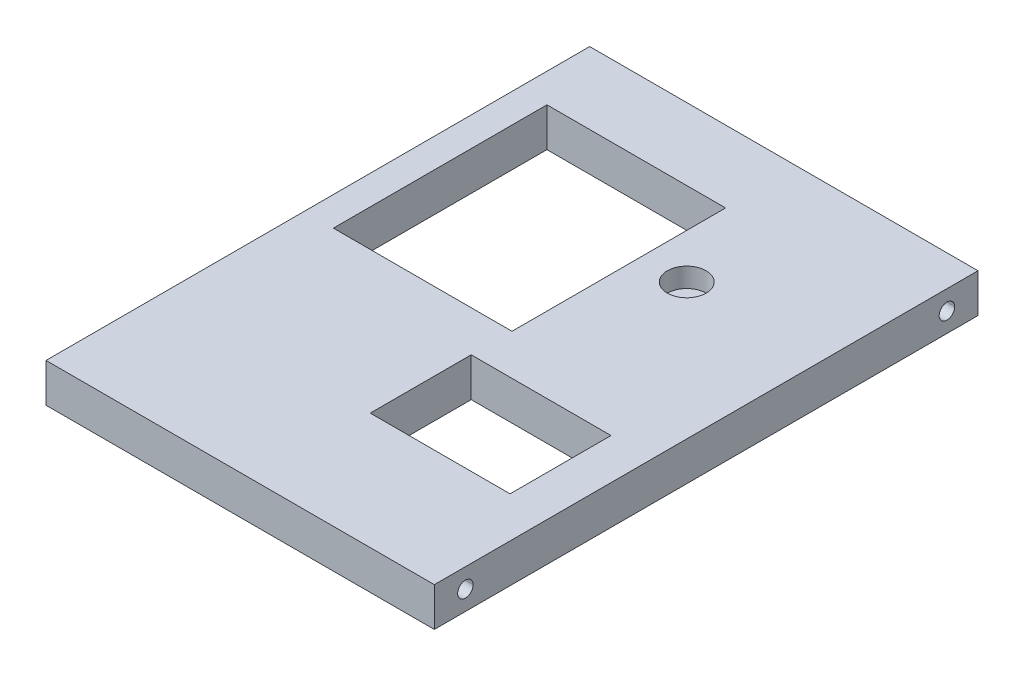
ISO-10303-21;
HEADER;
FILE_DESCRIPTION(('STEP AP214'),'2;1');
FILE_NAME('part.step','',(''),(''),'','','');
FILE_SCHEMA(('AUTOMOTIVE_DESIGN { 1 0 10303 214 1 1 1 1 }'));
ENDSEC;
DATA;
#1=APPLICATION_CONTEXT('core data for automotive mechanical design processes');
#2=APPLICATION_PROTOCOL_DEFINITION('international standard','automotive_design',2000,#1);
#3=PRODUCT_CONTEXT('',#1,'mechanical');
#4=PRODUCT('Part','Part','',(#3));
#5=PRODUCT_RELATED_PRODUCT_CATEGORY('part','',(#4));
#6=PRODUCT_DEFINITION_FORMATION('','',#4);
#7=PRODUCT_DEFINITION_CONTEXT('part definition',#1,'design');
#8=PRODUCT_DEFINITION('design','',#6,#7);
#9=PRODUCT_DEFINITION_SHAPE('','',#8);
#10=(LENGTH_UNIT() NAMED_UNIT(*) SI_UNIT(.MILLI.,.METRE.));
#11=(NAMED_UNIT(*) PLANE_ANGLE_UNIT() SI_UNIT($,.RADIAN.));
#12=(NAMED_UNIT(*) SI_UNIT($,.STERADIAN.) SOLID_ANGLE_UNIT());
#13=UNCERTAINTY_MEASURE_WITH_UNIT(LENGTH_MEASURE(1.E-05),#10,'distance_accuracy_value','');
#14=(GEOMETRIC_REPRESENTATION_CONTEXT(3) GLOBAL_UNCERTAINTY_ASSIGNED_CONTEXT((#13)) GLOBAL_UNIT_ASSIGNED_CONTEXT((#10,
#11,#12)) REPRESENTATION_CONTEXT('',''));
#15=CARTESIAN_POINT('',(0.,0.,0.));
#16=DIRECTION('',(0.,0.,1.));
#17=DIRECTION('',(1.,0.,0.));
#18=AXIS2_PLACEMENT_3D('',#15,#16,#17);
#19=CARTESIAN_POINT('',(100.,5.,-132.));
#20=DIRECTION('',(-1.,0.,0.));
#21=DIRECTION('',(0.,0.,1.));
#22=AXIS2_PLACEMENT_3D('',#19,#20,#21);
#23=CYLINDRICAL_SURFACE('',#22,2.);
#24=DIRECTION('',(-1.,0.,0.));
#25=VECTOR('',#24,1.);
#26=CARTESIAN_POINT('',(100.,5.,-134.));
#27=LINE('',#26,#25);
#28=CARTESIAN_POINT('',(0.,5.,-134.));
#29=VERTEX_POINT('',#28);
#30=CARTESIAN_POINT('',(100.,5.,-134.));
#31=VERTEX_POINT('',#30);
#32=EDGE_CURVE('E12',#29,#31,#27,.F.);
#33=ORIENTED_EDGE('',*,*,#32,.F.);
#34=CARTESIAN_POINT('',(0.,5.,-132.));
#35=DIRECTION('',(-1.,0.,0.));
#36=DIRECTION('',(0.,0.,1.));
#37=AXIS2_PLACEMENT_3D('',#34,#35,#36);
#38=CIRCLE('',#37,2.);
#39=CARTESIAN_POINT('',(0.,5.,-130.));
#40=VERTEX_POINT('',#39);
#41=EDGE_CURVE('E210',#29,#40,#38,.T.);
#42=ORIENTED_EDGE('',*,*,#41,.T.);
#43=DIRECTION('',(-1.,0.,0.));
#44=VECTOR('',#43,1.);
#45=CARTESIAN_POINT('',(100.,5.,-130.));
#46=LINE('',#45,#44);
#47=CARTESIAN_POINT('',(100.,5.,-130.));
#48=VERTEX_POINT('',#47);
#49=EDGE_CURVE('E56',#48,#40,#46,.T.);
#50=ORIENTED_EDGE('',*,*,#49,.F.);
#51=CARTESIAN_POINT('',(100.,5.,-132.));
#52=DIRECTION('',(-1.,0.,0.));
#53=DIRECTION('',(0.,0.,1.));
#54=AXIS2_PLACEMENT_3D('',#51,#52,#53);
#55=CIRCLE('',#54,2.);
#56=EDGE_CURVE('E264',#31,#48,#55,.T.);
#57=ORIENTED_EDGE('',*,*,#56,.F.);
#58=EDGE_LOOP('',(#33,#42,#50,#57));
#59=FACE_BOUND('',#58,.T.);
#60=ADVANCED_FACE('F47',(#59),#23,.F.);
#61=CARTESIAN_POINT('',(100.,5.,-8.00000000000001));
#62=DIRECTION('',(-1.,0.,0.));
#63=DIRECTION('',(0.,0.,1.));
#64=AXIS2_PLACEMENT_3D('',#61,#62,#63);
#65=CYLINDRICAL_SURFACE('',#64,2.);
#66=DIRECTION('',(-1.,0.,0.));
#67=VECTOR('',#66,1.);
#68=CARTESIAN_POINT('',(100.,5.,-10.));
#69=LINE('',#68,#67);
#70=CARTESIAN_POINT('',(0.,5.,-10.));
#71=VERTEX_POINT('',#70);
#72=CARTESIAN_POINT('',(100.,5.,-10.));
#73=VERTEX_POINT('',#72);
#74=EDGE_CURVE('E330',#71,#73,#69,.F.);
#75=ORIENTED_EDGE('',*,*,#74,.F.);
#76=CARTESIAN_POINT('',(0.,5.,-8.00000000000001));
#77=DIRECTION('',(-1.,0.,0.));
#78=DIRECTION('',(0.,0.,1.));
#79=AXIS2_PLACEMENT_3D('',#76,#77,#78);
#80=CIRCLE('',#79,2.);
#81=CARTESIAN_POINT('',(0.,5.,-6.00000000000001));
#82=VERTEX_POINT('',#81);
#83=EDGE_CURVE('E263',#71,#82,#80,.T.);
#84=ORIENTED_EDGE('',*,*,#83,.T.);
#85=DIRECTION('',(-1.,0.,0.));
#86=VECTOR('',#85,1.);
#87=CARTESIAN_POINT('',(100.,5.,-6.00000000000001));
#88=LINE('',#87,#86);
#89=CARTESIAN_POINT('',(100.,5.,-6.00000000000001));
#90=VERTEX_POINT('',#89);
#91=EDGE_CURVE('E327',#90,#82,#88,.T.);
#92=ORIENTED_EDGE('',*,*,#91,.F.);
#93=CARTESIAN_POINT('',(100.,5.,-8.00000000000001));
#94=DIRECTION('',(-1.,0.,0.));
#95=DIRECTION('',(0.,0.,1.));
#96=AXIS2_PLACEMENT_3D('',#93,#94,#95);
#97=CIRCLE('',#96,2.);
#98=EDGE_CURVE('E273',#73,#90,#97,.T.);
#99=ORIENTED_EDGE('',*,*,#98,.F.);
#100=EDGE_LOOP('',(#75,#84,#92,#99));
#101=FACE_BOUND('',#100,.T.);
#102=ADVANCED_FACE('F391',(#101),#65,.F.);
#103=CARTESIAN_POINT('',(100.,10.,0.));
#104=DIRECTION('',(0.,0.,-1.));
#105=DIRECTION('',(-1.,0.,0.));
#106=AXIS2_PLACEMENT_3D('',#103,#104,#105);
#107=PLANE('',#106);
#108=DIRECTION('',(1.,0.,0.));
#109=VECTOR('',#108,1.);
#110=CARTESIAN_POINT('',(100.,0.,0.));
#111=LINE('',#110,#109);
#112=CARTESIAN_POINT('',(0.,0.,0.));
#113=VERTEX_POINT('',#112);
#114=CARTESIAN_POINT('',(100.,0.,0.));
#115=VERTEX_POINT('',#114);
#116=EDGE_CURVE('E282',#113,#115,#111,.T.);
#117=ORIENTED_EDGE('',*,*,#116,.T.);
#118=DIRECTION('',(0.,-1.,0.));
#119=VECTOR('',#118,1.);
#120=CARTESIAN_POINT('',(100.,10.,0.));
#121=LINE('',#120,#119);
#122=CARTESIAN_POINT('',(100.,10.,0.));
#123=VERTEX_POINT('',#122);
#124=EDGE_CURVE('E323',#123,#115,#121,.T.);
#125=ORIENTED_EDGE('',*,*,#124,.F.);
#126=DIRECTION('',(1.,0.,0.));
#127=VECTOR('',#126,1.);
#128=CARTESIAN_POINT('',(100.,10.,0.));
#129=LINE('',#128,#127);
#130=CARTESIAN_POINT('',(0.,10.,0.));
#131=VERTEX_POINT('',#130);
#132=EDGE_CURVE('E286',#131,#123,#129,.T.);
#133=ORIENTED_EDGE('',*,*,#132,.F.);
#134=DIRECTION('',(0.,-1.,0.));
#135=VECTOR('',#134,1.);
#136=CARTESIAN_POINT('',(0.,10.,0.));
#137=LINE('',#136,#135);
#138=EDGE_CURVE('E300',#131,#113,#137,.T.);
#139=ORIENTED_EDGE('',*,*,#138,.T.);
#140=EDGE_LOOP('',(#117,#125,#133,#139));
#141=FACE_BOUND('',#140,.T.);
#142=ADVANCED_FACE('F49',(#141),#107,.F.);
#143=CARTESIAN_POINT('',(100.,10.,-140.));
#144=DIRECTION('',(-1.,0.,0.));
#145=DIRECTION('',(0.,0.,1.));
#146=AXIS2_PLACEMENT_3D('',#143,#144,#145);
#147=PLANE('',#146);
#148=EDGE_CURVE('E259',#48,#31,#55,.T.);
#149=ORIENTED_EDGE('',*,*,#148,.T.);
#150=ORIENTED_EDGE('',*,*,#56,.T.);
#151=EDGE_LOOP('',(#149,#150));
#152=FACE_BOUND('',#151,.T.);
#153=EDGE_CURVE('E267',#90,#73,#97,.T.);
#154=ORIENTED_EDGE('',*,*,#153,.T.);
#155=ORIENTED_EDGE('',*,*,#98,.T.);
#156=EDGE_LOOP('',(#154,#155));
#157=FACE_BOUND('',#156,.T.);
#158=DIRECTION('',(0.,0.,-1.));
#159=VECTOR('',#158,1.);
#160=CARTESIAN_POINT('',(100.,0.,-140.));
#161=LINE('',#160,#159);
#162=CARTESIAN_POINT('',(100.,0.,-140.));
#163=VERTEX_POINT('',#162);
#164=EDGE_CURVE('E304',#115,#163,#161,.T.);
#165=ORIENTED_EDGE('',*,*,#164,.T.);
#166=DIRECTION('',(0.,-1.,0.));
#167=VECTOR('',#166,1.);
#168=CARTESIAN_POINT('',(100.,10.,-140.));
#169=LINE('',#168,#167);
#170=CARTESIAN_POINT('',(100.,10.,-140.));
#171=VERTEX_POINT('',#170);
#172=EDGE_CURVE('E319',#171,#163,#169,.T.);
#173=ORIENTED_EDGE('',*,*,#172,.F.);
#174=DIRECTION('',(0.,0.,-1.));
#175=VECTOR('',#174,1.);
#176=CARTESIAN_POINT('',(100.,10.,-140.));
#177=LINE('',#176,#175);
#178=EDGE_CURVE('E290',#123,#171,#177,.T.);
#179=ORIENTED_EDGE('',*,*,#178,.F.);
#180=ORIENTED_EDGE('',*,*,#124,.T.);
#181=EDGE_LOOP('',(#165,#173,#179,#180));
#182=FACE_BOUND('',#181,.T.);
#183=ADVANCED_FACE('F356',(#152,#157,#182),#147,.F.);
#184=CARTESIAN_POINT('',(0.,10.,-140.));
#185=DIRECTION('',(0.,0.,1.));
#186=DIRECTION('',(1.,0.,0.));
#187=AXIS2_PLACEMENT_3D('',#184,#185,#186);
#188=PLANE('',#187);
#189=DIRECTION('',(-1.,0.,0.));
#190=VECTOR('',#189,1.);
#191=CARTESIAN_POINT('',(0.,0.,-140.));
#192=LINE('',#191,#190);
#193=CARTESIAN_POINT('',(0.,0.,-140.));
#194=VERTEX_POINT('',#193);
#195=EDGE_CURVE('E307',#163,#194,#192,.T.);
#196=ORIENTED_EDGE('',*,*,#195,.T.);
#197=DIRECTION('',(0.,-1.,0.));
#198=VECTOR('',#197,1.);
#199=CARTESIAN_POINT('',(0.,10.,-140.));
#200=LINE('',#199,#198);
#201=CARTESIAN_POINT('',(0.,10.,-140.));
#202=VERTEX_POINT('',#201);
#203=EDGE_CURVE('E315',#202,#194,#200,.T.);
#204=ORIENTED_EDGE('',*,*,#203,.F.);
#205=DIRECTION('',(-1.,0.,0.));
#206=VECTOR('',#205,1.);
#207=CARTESIAN_POINT('',(0.,10.,-140.));
#208=LINE('',#207,#206);
#209=EDGE_CURVE('E294',#171,#202,#208,.T.);
#210=ORIENTED_EDGE('',*,*,#209,.F.);
#211=ORIENTED_EDGE('',*,*,#172,.T.);
#212=EDGE_LOOP('',(#196,#204,#210,#211));
#213=FACE_BOUND('',#212,.T.);
#214=ADVANCED_FACE('F359',(#213),#188,.F.);
#215=CARTESIAN_POINT('',(0.,10.,0.));
#216=DIRECTION('',(1.,0.,0.));
#217=DIRECTION('',(0.,0.,-1.));
#218=AXIS2_PLACEMENT_3D('',#215,#216,#217);
#219=PLANE('',#218);
#220=EDGE_CURVE('E265',#40,#29,#38,.T.);
#221=ORIENTED_EDGE('',*,*,#220,.F.);
#222=ORIENTED_EDGE('',*,*,#41,.F.);
#223=EDGE_LOOP('',(#221,#222));
#224=FACE_BOUND('',#223,.T.);
#225=EDGE_CURVE('E274',#82,#71,#80,.T.);
#226=ORIENTED_EDGE('',*,*,#225,.F.);
#227=ORIENTED_EDGE('',*,*,#83,.F.);
#228=EDGE_LOOP('',(#226,#227));
#229=FACE_BOUND('',#228,.T.);
#230=DIRECTION('',(0.,0.,1.));
#231=VECTOR('',#230,1.);
#232=CARTESIAN_POINT('',(0.,0.,0.));
#233=LINE('',#232,#231);
#234=EDGE_CURVE('E291',#194,#113,#233,.T.);
#235=ORIENTED_EDGE('',*,*,#234,.T.);
#236=ORIENTED_EDGE('',*,*,#138,.F.);
#237=DIRECTION('',(0.,0.,1.));
#238=VECTOR('',#237,1.);
#239=CARTESIAN_POINT('',(0.,10.,0.));
#240=LINE('',#239,#238);
#241=EDGE_CURVE('E297',#202,#131,#240,.T.);
#242=ORIENTED_EDGE('',*,*,#241,.F.);
#243=ORIENTED_EDGE('',*,*,#203,.T.);
#244=EDGE_LOOP('',(#235,#236,#242,#243));
#245=FACE_BOUND('',#244,.T.);
#246=ADVANCED_FACE('F352',(#224,#229,#245),#219,.F.);
#247=CARTESIAN_POINT('',(0.,10.,0.));
#248=DIRECTION('',(0.,-1.,0.));
#249=DIRECTION('',(0.,0.,-1.));
#250=AXIS2_PLACEMENT_3D('',#247,#248,#249);
#251=PLANE('',#250);
#252=DIRECTION('',(-1.,0.,0.));
#253=VECTOR('',#252,1.);
#254=CARTESIAN_POINT('',(7.49999999999999,10.,-121.5));
#255=LINE('',#254,#253);
#256=CARTESIAN_POINT('',(53.5,10.,-121.5));
#257=VERTEX_POINT('',#256);
#258=CARTESIAN_POINT('',(7.49999999999999,10.,-121.5));
#259=VERTEX_POINT('',#258);
#260=EDGE_CURVE('E200',#257,#259,#255,.T.);
#261=ORIENTED_EDGE('',*,*,#260,.F.);
#262=DIRECTION('',(0.,0.,-1.));
#263=VECTOR('',#262,1.);
#264=CARTESIAN_POINT('',(53.5,10.,-121.5));
#265=LINE('',#264,#263);
#266=CARTESIAN_POINT('',(53.5,10.,-66.5));
#267=VERTEX_POINT('',#266);
#268=EDGE_CURVE('E166',#267,#257,#265,.T.);
#269=ORIENTED_EDGE('',*,*,#268,.F.);
#270=DIRECTION('',(1.,0.,0.));
#271=VECTOR('',#270,1.);
#272=CARTESIAN_POINT('',(7.5,10.,-66.5));
#273=LINE('',#272,#271);
#274=CARTESIAN_POINT('',(7.5,10.,-66.5));
#275=VERTEX_POINT('',#274);
#276=EDGE_CURVE('E187',#275,#267,#273,.T.);
#277=ORIENTED_EDGE('',*,*,#276,.F.);
#278=DIRECTION('',(0.,0.,1.));
#279=VECTOR('',#278,1.);
#280=CARTESIAN_POINT('',(7.49999999999999,10.,-121.5));
#281=LINE('',#280,#279);
#282=EDGE_CURVE('E191',#259,#275,#281,.T.);
#283=ORIENTED_EDGE('',*,*,#282,.F.);
#284=EDGE_LOOP('',(#261,#269,#277,#283));
#285=FACE_BOUND('',#284,.T.);
#286=DIRECTION('',(0.,0.,1.));
#287=VECTOR('',#286,1.);
#288=CARTESIAN_POINT('',(53.5,10.,-56.));
#289=LINE('',#288,#287);
#290=CARTESIAN_POINT('',(53.5,10.,-56.));
#291=VERTEX_POINT('',#290);
#292=CARTESIAN_POINT('',(53.5,10.,-30.));
#293=VERTEX_POINT('',#292);
#294=EDGE_CURVE('E237',#291,#293,#289,.T.);
#295=ORIENTED_EDGE('',*,*,#294,.F.);
#296=DIRECTION('',(-1.,0.,0.));
#297=VECTOR('',#296,1.);
#298=CARTESIAN_POINT('',(89.5,10.,-56.));
#299=LINE('',#298,#297);
#300=CARTESIAN_POINT('',(89.5,10.,-56.));
#301=VERTEX_POINT('',#300);
#302=EDGE_CURVE('E234',#301,#291,#299,.T.);
#303=ORIENTED_EDGE('',*,*,#302,.F.);
#304=DIRECTION('',(0.,0.,-1.));
#305=VECTOR('',#304,1.);
#306=CARTESIAN_POINT('',(89.5,10.,-30.));
#307=LINE('',#306,#305);
#308=CARTESIAN_POINT('',(89.5,10.,-30.));
#309=VERTEX_POINT('',#308);
#310=EDGE_CURVE('E221',#309,#301,#307,.T.);
#311=ORIENTED_EDGE('',*,*,#310,.F.);
#312=DIRECTION('',(1.,0.,0.));
#313=VECTOR('',#312,1.);
#314=CARTESIAN_POINT('',(53.5,10.,-30.));
#315=LINE('',#314,#313);
#316=EDGE_CURVE('E241',#293,#309,#315,.T.);
#317=ORIENTED_EDGE('',*,*,#316,.F.);
#318=EDGE_LOOP('',(#295,#303,#311,#317));
#319=FACE_BOUND('',#318,.T.);
#320=CARTESIAN_POINT('',(65.,10.,-100.));
#321=DIRECTION('',(0.,1.,0.));
#322=DIRECTION('',(0.,0.,1.));
#323=AXIS2_PLACEMENT_3D('',#320,#321,#322);
#324=CIRCLE('',#323,5.00000000000001);
#325=CARTESIAN_POINT('',(65.,10.,-95.));
#326=VERTEX_POINT('',#325);
#327=EDGE_CURVE('E272',#326,#326,#324,.T.);
#328=ORIENTED_EDGE('',*,*,#327,.F.);
#329=EDGE_LOOP('',(#328));
#330=FACE_BOUND('',#329,.T.);
#331=ORIENTED_EDGE('',*,*,#132,.T.);
#332=ORIENTED_EDGE('',*,*,#178,.T.);
#333=ORIENTED_EDGE('',*,*,#209,.T.);
#334=ORIENTED_EDGE('',*,*,#241,.T.);
#335=EDGE_LOOP('',(#331,#332,#333,#334));
#336=FACE_BOUND('',#335,.T.);
#337=ADVANCED_FACE('F377',(#285,#319,#330,#336),#251,.F.);
#338=CARTESIAN_POINT('',(0.,0.,0.));
#339=DIRECTION('',(0.,-1.,0.));
#340=DIRECTION('',(0.,0.,-1.));
#341=AXIS2_PLACEMENT_3D('',#338,#339,#340);
#342=PLANE('',#341);
#343=DIRECTION('',(0.,0.,-1.));
#344=VECTOR('',#343,1.);
#345=CARTESIAN_POINT('',(53.5,0.,-121.5));
#346=LINE('',#345,#344);
#347=CARTESIAN_POINT('',(53.5,0.,-66.5));
#348=VERTEX_POINT('',#347);
#349=CARTESIAN_POINT('',(53.5,0.,-121.5));
#350=VERTEX_POINT('',#349);
#351=EDGE_CURVE('E163',#348,#350,#346,.T.);
#352=ORIENTED_EDGE('',*,*,#351,.T.);
#353=DIRECTION('',(-1.,0.,0.));
#354=VECTOR('',#353,1.);
#355=CARTESIAN_POINT('',(7.49999999999999,0.,-121.5));
#356=LINE('',#355,#354);
#357=CARTESIAN_POINT('',(7.49999999999999,0.,-121.5));
#358=VERTEX_POINT('',#357);
#359=EDGE_CURVE('E176',#350,#358,#356,.T.);
#360=ORIENTED_EDGE('',*,*,#359,.T.);
#361=DIRECTION('',(0.,0.,1.));
#362=VECTOR('',#361,1.);
#363=CARTESIAN_POINT('',(7.49999999999999,0.,-121.5));
#364=LINE('',#363,#362);
#365=CARTESIAN_POINT('',(7.5,0.,-66.5));
#366=VERTEX_POINT('',#365);
#367=EDGE_CURVE('E181',#358,#366,#364,.T.);
#368=ORIENTED_EDGE('',*,*,#367,.T.);
#369=DIRECTION('',(1.,0.,0.));
#370=VECTOR('',#369,1.);
#371=CARTESIAN_POINT('',(7.5,0.,-66.5));
#372=LINE('',#371,#370);
#373=EDGE_CURVE('E172',#366,#348,#372,.T.);
#374=ORIENTED_EDGE('',*,*,#373,.T.);
#375=EDGE_LOOP('',(#352,#360,#368,#374));
#376=FACE_BOUND('',#375,.T.);
#377=DIRECTION('',(-1.,0.,0.));
#378=VECTOR('',#377,1.);
#379=CARTESIAN_POINT('',(89.5,0.,-56.));
#380=LINE('',#379,#378);
#381=CARTESIAN_POINT('',(89.5,0.,-56.));
#382=VERTEX_POINT('',#381);
#383=CARTESIAN_POINT('',(53.5,0.,-56.));
#384=VERTEX_POINT('',#383);
#385=EDGE_CURVE('E216',#382,#384,#380,.T.);
#386=ORIENTED_EDGE('',*,*,#385,.T.);
#387=DIRECTION('',(0.,0.,1.));
#388=VECTOR('',#387,1.);
#389=CARTESIAN_POINT('',(53.5,0.,-56.));
#390=LINE('',#389,#388);
#391=CARTESIAN_POINT('',(53.5,0.,-30.));
#392=VERTEX_POINT('',#391);
#393=EDGE_CURVE('E220',#384,#392,#390,.T.);
#394=ORIENTED_EDGE('',*,*,#393,.T.);
#395=DIRECTION('',(1.,0.,0.));
#396=VECTOR('',#395,1.);
#397=CARTESIAN_POINT('',(53.5,0.,-30.));
#398=LINE('',#397,#396);
#399=CARTESIAN_POINT('',(89.5,0.,-30.));
#400=VERTEX_POINT('',#399);
#401=EDGE_CURVE('E225',#392,#400,#398,.T.);
#402=ORIENTED_EDGE('',*,*,#401,.T.);
#403=DIRECTION('',(0.,0.,-1.));
#404=VECTOR('',#403,1.);
#405=CARTESIAN_POINT('',(89.5,0.,-30.));
#406=LINE('',#405,#404);
#407=EDGE_CURVE('E229',#400,#382,#406,.T.);
#408=ORIENTED_EDGE('',*,*,#407,.T.);
#409=EDGE_LOOP('',(#386,#394,#402,#408));
#410=FACE_BOUND('',#409,.T.);
#411=ORIENTED_EDGE('',*,*,#116,.F.);
#412=ORIENTED_EDGE('',*,*,#234,.F.);
#413=ORIENTED_EDGE('',*,*,#195,.F.);
#414=ORIENTED_EDGE('',*,*,#164,.F.);
#415=EDGE_LOOP('',(#411,#412,#413,#414));
#416=FACE_BOUND('',#415,.T.);
#417=ADVANCED_FACE('F183',(#376,#410,#416),#342,.T.);
#418=CARTESIAN_POINT('',(65.,5.,-100.));
#419=DIRECTION('',(0.,1.,0.));
#420=DIRECTION('',(0.,0.,1.));
#421=AXIS2_PLACEMENT_3D('',#418,#419,#420);
#422=CYLINDRICAL_SURFACE('',#421,5.00000000000001);
#423=CARTESIAN_POINT('',(65.,5.,-100.));
#424=DIRECTION('',(0.,1.,0.));
#425=DIRECTION('',(0.,0.,1.));
#426=AXIS2_PLACEMENT_3D('',#423,#424,#425);
#427=CIRCLE('',#426,5.00000000000001);
#428=CARTESIAN_POINT('',(65.,5.,-95.));
#429=VERTEX_POINT('',#428);
#430=EDGE_CURVE('E278',#429,#429,#427,.T.);
#431=ORIENTED_EDGE('',*,*,#430,.F.);
#432=EDGE_LOOP('',(#431));
#433=FACE_BOUND('',#432,.T.);
#434=ORIENTED_EDGE('',*,*,#327,.T.);
#435=EDGE_LOOP('',(#434));
#436=FACE_BOUND('',#435,.T.);
#437=ADVANCED_FACE('F385',(#433,#436),#422,.F.);
#438=CARTESIAN_POINT('',(65.,5.,-100.));
#439=DIRECTION('',(0.,1.,0.));
#440=DIRECTION('',(0.,0.,1.));
#441=AXIS2_PLACEMENT_3D('',#438,#439,#440);
#442=PLANE('',#441);
#443=ORIENTED_EDGE('',*,*,#430,.T.);
#444=EDGE_LOOP('',(#443));
#445=FACE_BOUND('',#444,.T.);
#446=ADVANCED_FACE('F408',(#445),#442,.T.);
#447=ORIENTED_EDGE('',*,*,#225,.T.);
#448=ORIENTED_EDGE('',*,*,#74,.T.);
#449=ORIENTED_EDGE('',*,*,#153,.F.);
#450=ORIENTED_EDGE('',*,*,#91,.T.);
#451=EDGE_LOOP('',(#447,#448,#449,#450));
#452=FACE_BOUND('',#451,.T.);
#453=ADVANCED_FACE('F398',(#452),#65,.F.);
#454=ORIENTED_EDGE('',*,*,#220,.T.);
#455=ORIENTED_EDGE('',*,*,#32,.T.);
#456=ORIENTED_EDGE('',*,*,#148,.F.);
#457=ORIENTED_EDGE('',*,*,#49,.T.);
#458=EDGE_LOOP('',(#454,#455,#456,#457));
#459=FACE_BOUND('',#458,.T.);
#460=ADVANCED_FACE('F354',(#459),#23,.F.);
#461=CARTESIAN_POINT('',(89.5,0.,-56.));
#462=DIRECTION('',(0.,0.,-1.));
#463=DIRECTION('',(-1.,0.,0.));
#464=AXIS2_PLACEMENT_3D('',#461,#462,#463);
#465=PLANE('',#464);
#466=ORIENTED_EDGE('',*,*,#302,.T.);
#467=DIRECTION('',(0.,1.,0.));
#468=VECTOR('',#467,1.);
#469=CARTESIAN_POINT('',(53.5,0.,-56.));
#470=LINE('',#469,#468);
#471=EDGE_CURVE('E233',#384,#291,#470,.T.);
#472=ORIENTED_EDGE('',*,*,#471,.F.);
#473=ORIENTED_EDGE('',*,*,#385,.F.);
#474=DIRECTION('',(0.,1.,0.));
#475=VECTOR('',#474,1.);
#476=CARTESIAN_POINT('',(89.5,0.,-56.));
#477=LINE('',#476,#475);
#478=EDGE_CURVE('E201',#382,#301,#477,.T.);
#479=ORIENTED_EDGE('',*,*,#478,.T.);
#480=EDGE_LOOP('',(#466,#472,#473,#479));
#481=FACE_BOUND('',#480,.T.);
#482=ADVANCED_FACE('F401',(#481),#465,.F.);
#483=CARTESIAN_POINT('',(89.5,0.,-30.));
#484=DIRECTION('',(1.,0.,0.));
#485=DIRECTION('',(0.,0.,-1.));
#486=AXIS2_PLACEMENT_3D('',#483,#484,#485);
#487=PLANE('',#486);
#488=ORIENTED_EDGE('',*,*,#310,.T.);
#489=ORIENTED_EDGE('',*,*,#478,.F.);
#490=ORIENTED_EDGE('',*,*,#407,.F.);
#491=DIRECTION('',(0.,1.,0.));
#492=VECTOR('',#491,1.);
#493=CARTESIAN_POINT('',(89.5,0.,-30.));
#494=LINE('',#493,#492);
#495=EDGE_CURVE('E250',#400,#309,#494,.T.);
#496=ORIENTED_EDGE('',*,*,#495,.T.);
#497=EDGE_LOOP('',(#488,#489,#490,#496));
#498=FACE_BOUND('',#497,.T.);
#499=ADVANCED_FACE('F406',(#498),#487,.F.);
#500=CARTESIAN_POINT('',(53.5,0.,-30.));
#501=DIRECTION('',(0.,0.,1.));
#502=DIRECTION('',(1.,0.,0.));
#503=AXIS2_PLACEMENT_3D('',#500,#501,#502);
#504=PLANE('',#503);
#505=ORIENTED_EDGE('',*,*,#316,.T.);
#506=ORIENTED_EDGE('',*,*,#495,.F.);
#507=ORIENTED_EDGE('',*,*,#401,.F.);
#508=DIRECTION('',(0.,1.,0.));
#509=VECTOR('',#508,1.);
#510=CARTESIAN_POINT('',(53.5,0.,-30.));
#511=LINE('',#510,#509);
#512=EDGE_CURVE('E253',#392,#293,#511,.T.);
#513=ORIENTED_EDGE('',*,*,#512,.T.);
#514=EDGE_LOOP('',(#505,#506,#507,#513));
#515=FACE_BOUND('',#514,.T.);
#516=ADVANCED_FACE('F455',(#515),#504,.F.);
#517=CARTESIAN_POINT('',(53.5,0.,-56.));
#518=DIRECTION('',(-1.,0.,0.));
#519=DIRECTION('',(0.,0.,1.));
#520=AXIS2_PLACEMENT_3D('',#517,#518,#519);
#521=PLANE('',#520);
#522=ORIENTED_EDGE('',*,*,#294,.T.);
#523=ORIENTED_EDGE('',*,*,#512,.F.);
#524=ORIENTED_EDGE('',*,*,#393,.F.);
#525=ORIENTED_EDGE('',*,*,#471,.T.);
#526=EDGE_LOOP('',(#522,#523,#524,#525));
#527=FACE_BOUND('',#526,.T.);
#528=ADVANCED_FACE('F465',(#527),#521,.F.);
#529=CARTESIAN_POINT('',(53.5,0.,-121.5));
#530=DIRECTION('',(1.,0.,0.));
#531=DIRECTION('',(0.,0.,-1.));
#532=AXIS2_PLACEMENT_3D('',#529,#530,#531);
#533=PLANE('',#532);
#534=ORIENTED_EDGE('',*,*,#268,.T.);
#535=DIRECTION('',(0.,1.,0.));
#536=VECTOR('',#535,1.);
#537=CARTESIAN_POINT('',(53.5,0.,-121.5));
#538=LINE('',#537,#536);
#539=EDGE_CURVE('E159',#350,#257,#538,.T.);
#540=ORIENTED_EDGE('',*,*,#539,.F.);
#541=ORIENTED_EDGE('',*,*,#351,.F.);
#542=DIRECTION('',(0.,1.,0.));
#543=VECTOR('',#542,1.);
#544=CARTESIAN_POINT('',(53.5,0.,-66.5));
#545=LINE('',#544,#543);
#546=EDGE_CURVE('E207',#348,#267,#545,.T.);
#547=ORIENTED_EDGE('',*,*,#546,.T.);
#548=EDGE_LOOP('',(#534,#540,#541,#547));
#549=FACE_BOUND('',#548,.T.);
#550=ADVANCED_FACE('F161',(#549),#533,.F.);
#551=CARTESIAN_POINT('',(7.5,0.,-66.5));
#552=DIRECTION('',(0.,0.,1.));
#553=DIRECTION('',(1.,0.,0.));
#554=AXIS2_PLACEMENT_3D('',#551,#552,#553);
#555=PLANE('',#554);
#556=ORIENTED_EDGE('',*,*,#276,.T.);
#557=ORIENTED_EDGE('',*,*,#546,.F.);
#558=ORIENTED_EDGE('',*,*,#373,.F.);
#559=DIRECTION('',(0.,1.,0.));
#560=VECTOR('',#559,1.);
#561=CARTESIAN_POINT('',(7.5,0.,-66.5));
#562=LINE('',#561,#560);
#563=EDGE_CURVE('E211',#366,#275,#562,.T.);
#564=ORIENTED_EDGE('',*,*,#563,.T.);
#565=EDGE_LOOP('',(#556,#557,#558,#564));
#566=FACE_BOUND('',#565,.T.);
#567=ADVANCED_FACE('F484',(#566),#555,.F.);
#568=CARTESIAN_POINT('',(7.49999999999999,0.,-121.5));
#569=DIRECTION('',(-1.,0.,0.));
#570=DIRECTION('',(0.,0.,1.));
#571=AXIS2_PLACEMENT_3D('',#568,#569,#570);
#572=PLANE('',#571);
#573=ORIENTED_EDGE('',*,*,#282,.T.);
#574=ORIENTED_EDGE('',*,*,#563,.F.);
#575=ORIENTED_EDGE('',*,*,#367,.F.);
#576=DIRECTION('',(0.,1.,0.));
#577=VECTOR('',#576,1.);
#578=CARTESIAN_POINT('',(7.49999999999999,0.,-121.5));
#579=LINE('',#578,#577);
#580=EDGE_CURVE('E171',#358,#259,#579,.T.);
#581=ORIENTED_EDGE('',*,*,#580,.T.);
#582=EDGE_LOOP('',(#573,#574,#575,#581));
#583=FACE_BOUND('',#582,.T.);
#584=ADVANCED_FACE('F493',(#583),#572,.F.);
#585=CARTESIAN_POINT('',(7.49999999999999,0.,-121.5));
#586=DIRECTION('',(0.,0.,-1.));
#587=DIRECTION('',(-1.,0.,0.));
#588=AXIS2_PLACEMENT_3D('',#585,#586,#587);
#589=PLANE('',#588);
#590=ORIENTED_EDGE('',*,*,#260,.T.);
#591=ORIENTED_EDGE('',*,*,#580,.F.);
#592=ORIENTED_EDGE('',*,*,#359,.F.);
#593=ORIENTED_EDGE('',*,*,#539,.T.);
#594=EDGE_LOOP('',(#590,#591,#592,#593));
#595=FACE_BOUND('',#594,.T.);
#596=ADVANCED_FACE('F177',(#595),#589,.F.);
#597=CLOSED_SHELL('',(#60,#102,#142,#183,#214,#246,#337,#417,#437,#446,#453,#460,#482,#499,#516,
#528,#550,#567,#584,#596));
#598=MANIFOLD_SOLID_BREP('B2',#597);
#599=ADVANCED_BREP_SHAPE_REPRESENTATION('',(#18,#598),#14);
#600=SHAPE_DEFINITION_REPRESENTATION(#9,#599);
ENDSEC;
END-ISO-10303-21;
